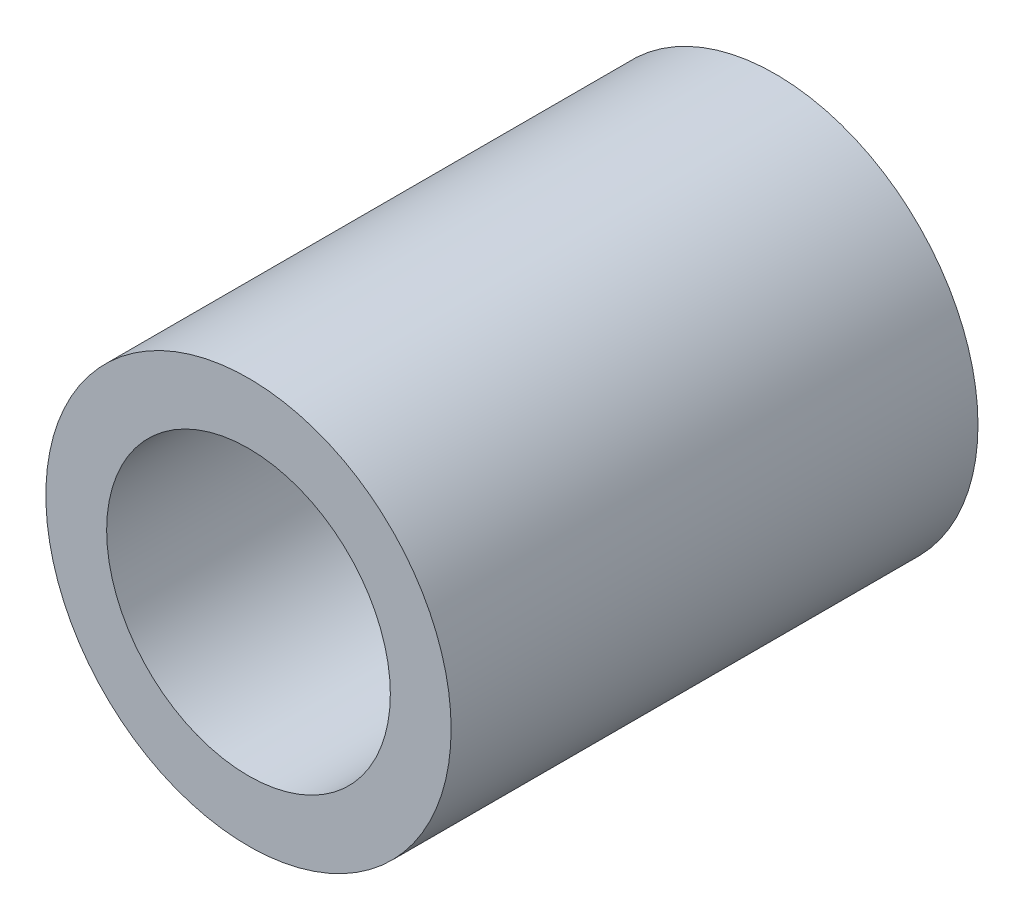
ISO-10303-21;
HEADER;
FILE_DESCRIPTION(('STEP AP214'),'2;1');
FILE_NAME('part.step','',(''),(''),'','','');
FILE_SCHEMA(('AUTOMOTIVE_DESIGN { 1 0 10303 214 1 1 1 1 }'));
ENDSEC;
DATA;
#1=APPLICATION_CONTEXT('core data for automotive mechanical design processes');
#2=APPLICATION_PROTOCOL_DEFINITION('international standard','automotive_design',2000,#1);
#3=PRODUCT_CONTEXT('',#1,'mechanical');
#4=PRODUCT('Part','Part','',(#3));
#5=PRODUCT_RELATED_PRODUCT_CATEGORY('part','',(#4));
#6=PRODUCT_DEFINITION_FORMATION('','',#4);
#7=PRODUCT_DEFINITION_CONTEXT('part definition',#1,'design');
#8=PRODUCT_DEFINITION('design','',#6,#7);
#9=PRODUCT_DEFINITION_SHAPE('','',#8);
#10=(LENGTH_UNIT() NAMED_UNIT(*) SI_UNIT(.MILLI.,.METRE.));
#11=(NAMED_UNIT(*) PLANE_ANGLE_UNIT() SI_UNIT($,.RADIAN.));
#12=(NAMED_UNIT(*) SI_UNIT($,.STERADIAN.) SOLID_ANGLE_UNIT());
#13=UNCERTAINTY_MEASURE_WITH_UNIT(LENGTH_MEASURE(1.E-05),#10,'distance_accuracy_value','');
#14=(GEOMETRIC_REPRESENTATION_CONTEXT(3) GLOBAL_UNCERTAINTY_ASSIGNED_CONTEXT((#13)) GLOBAL_UNIT_ASSIGNED_CONTEXT((#10,
#11,#12)) REPRESENTATION_CONTEXT('',''));
#15=CARTESIAN_POINT('',(0.,0.,0.));
#16=DIRECTION('',(0.,0.,1.));
#17=DIRECTION('',(1.,0.,0.));
#18=AXIS2_PLACEMENT_3D('',#15,#16,#17);
#19=CARTESIAN_POINT('',(0.,0.,6.5));
#20=DIRECTION('',(0.,0.,1.));
#21=DIRECTION('',(1.,0.,0.));
#22=AXIS2_PLACEMENT_3D('',#19,#20,#21);
#23=PLANE('',#22);
#24=CARTESIAN_POINT('',(0.,0.,6.5));
#25=DIRECTION('',(0.,0.,1.));
#26=DIRECTION('',(1.,0.,0.));
#27=AXIS2_PLACEMENT_3D('',#24,#25,#26);
#28=CIRCLE('',#27,2.5);
#29=CARTESIAN_POINT('',(2.5,0.,6.5));
#30=VERTEX_POINT('',#29);
#31=EDGE_CURVE('E10',#30,#30,#28,.T.);
#32=ORIENTED_EDGE('',*,*,#31,.T.);
#33=EDGE_LOOP('',(#32));
#34=FACE_BOUND('',#33,.T.);
#35=CARTESIAN_POINT('',(0.,0.,6.5));
#36=DIRECTION('',(0.,0.,1.));
#37=DIRECTION('',(1.,0.,0.));
#38=AXIS2_PLACEMENT_3D('',#35,#36,#37);
#39=CIRCLE('',#38,1.75);
#40=CARTESIAN_POINT('',(1.75,0.,6.5));
#41=VERTEX_POINT('',#40);
#42=EDGE_CURVE('E42',#41,#41,#39,.T.);
#43=ORIENTED_EDGE('',*,*,#42,.F.);
#44=EDGE_LOOP('',(#43));
#45=FACE_BOUND('',#44,.T.);
#46=ADVANCED_FACE('F31',(#34,#45),#23,.T.);
#47=CARTESIAN_POINT('',(0.,0.,0.));
#48=DIRECTION('',(0.,0.,1.));
#49=DIRECTION('',(1.,0.,0.));
#50=AXIS2_PLACEMENT_3D('',#47,#48,#49);
#51=PLANE('',#50);
#52=CARTESIAN_POINT('',(0.,0.,0.));
#53=DIRECTION('',(0.,0.,1.));
#54=DIRECTION('',(1.,0.,0.));
#55=AXIS2_PLACEMENT_3D('',#52,#53,#54);
#56=CIRCLE('',#55,2.5);
#57=CARTESIAN_POINT('',(2.5,0.,0.));
#58=VERTEX_POINT('',#57);
#59=EDGE_CURVE('E35',#58,#58,#56,.T.);
#60=ORIENTED_EDGE('',*,*,#59,.F.);
#61=EDGE_LOOP('',(#60));
#62=FACE_BOUND('',#61,.T.);
#63=CARTESIAN_POINT('',(0.,0.,0.));
#64=DIRECTION('',(0.,0.,1.));
#65=DIRECTION('',(1.,0.,0.));
#66=AXIS2_PLACEMENT_3D('',#63,#64,#65);
#67=CIRCLE('',#66,1.75);
#68=CARTESIAN_POINT('',(1.75,0.,0.));
#69=VERTEX_POINT('',#68);
#70=EDGE_CURVE('E44',#69,#69,#67,.T.);
#71=ORIENTED_EDGE('',*,*,#70,.T.);
#72=EDGE_LOOP('',(#71));
#73=FACE_BOUND('',#72,.T.);
#74=ADVANCED_FACE('F54',(#62,#73),#51,.F.);
#75=CARTESIAN_POINT('',(0.,0.,6.5));
#76=DIRECTION('',(0.,0.,-1.));
#77=DIRECTION('',(-1.,0.,0.));
#78=AXIS2_PLACEMENT_3D('',#75,#76,#77);
#79=CYLINDRICAL_SURFACE('',#78,2.5);
#80=ORIENTED_EDGE('',*,*,#31,.F.);
#81=EDGE_LOOP('',(#80));
#82=FACE_BOUND('',#81,.T.);
#83=ORIENTED_EDGE('',*,*,#59,.T.);
#84=EDGE_LOOP('',(#83));
#85=FACE_BOUND('',#84,.T.);
#86=ADVANCED_FACE('F33',(#82,#85),#79,.T.);
#87=CARTESIAN_POINT('',(0.,0.,6.5));
#88=DIRECTION('',(0.,0.,-1.));
#89=DIRECTION('',(-1.,0.,0.));
#90=AXIS2_PLACEMENT_3D('',#87,#88,#89);
#91=CYLINDRICAL_SURFACE('',#90,1.75);
#92=ORIENTED_EDGE('',*,*,#42,.T.);
#93=EDGE_LOOP('',(#92));
#94=FACE_BOUND('',#93,.T.);
#95=ORIENTED_EDGE('',*,*,#70,.F.);
#96=EDGE_LOOP('',(#95));
#97=FACE_BOUND('',#96,.T.);
#98=ADVANCED_FACE('F50',(#94,#97),#91,.F.);
#99=CLOSED_SHELL('',(#46,#74,#86,#98));
#100=MANIFOLD_SOLID_BREP('B2',#99);
#101=ADVANCED_BREP_SHAPE_REPRESENTATION('',(#18,#100),#14);
#102=SHAPE_DEFINITION_REPRESENTATION(#9,#101);
ENDSEC;
END-ISO-10303-21;
